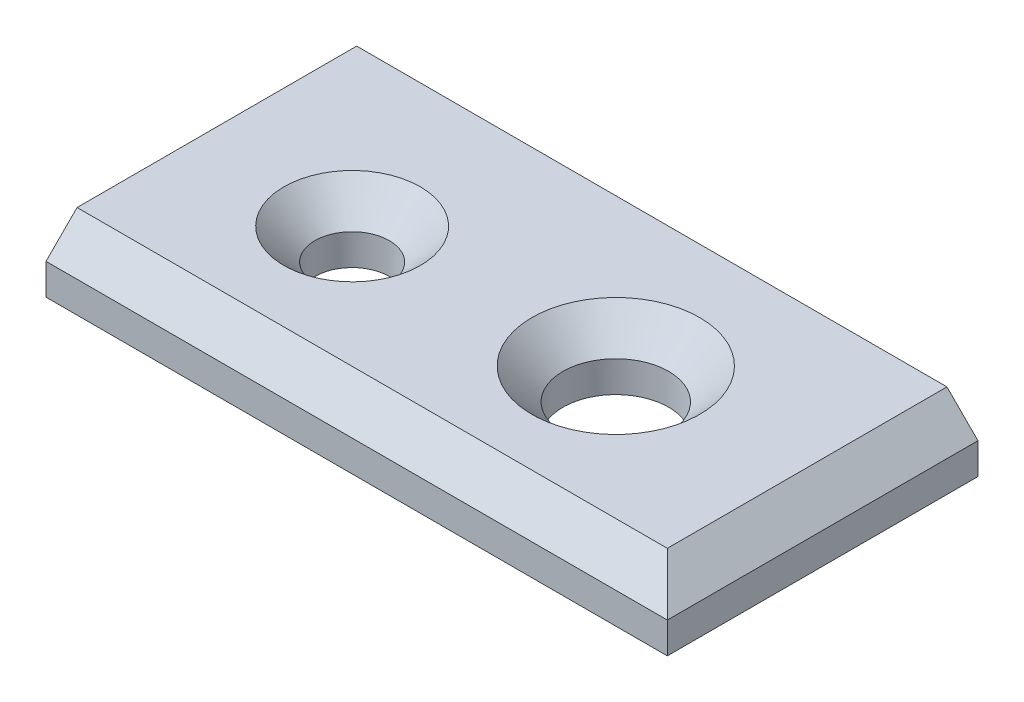
ISO-10303-21;
HEADER;
FILE_DESCRIPTION(('STEP AP214'),'2;1');
FILE_NAME('part.step','',(''),(''),'','','');
FILE_SCHEMA(('AUTOMOTIVE_DESIGN { 1 0 10303 214 1 1 1 1 }'));
ENDSEC;
DATA;
#1=APPLICATION_CONTEXT('core data for automotive mechanical design processes');
#2=APPLICATION_PROTOCOL_DEFINITION('international standard','automotive_design',2000,#1);
#3=PRODUCT_CONTEXT('',#1,'mechanical');
#4=PRODUCT('Part','Part','',(#3));
#5=PRODUCT_RELATED_PRODUCT_CATEGORY('part','',(#4));
#6=PRODUCT_DEFINITION_FORMATION('','',#4);
#7=PRODUCT_DEFINITION_CONTEXT('part definition',#1,'design');
#8=PRODUCT_DEFINITION('design','',#6,#7);
#9=PRODUCT_DEFINITION_SHAPE('','',#8);
#10=(LENGTH_UNIT() NAMED_UNIT(*) SI_UNIT(.MILLI.,.METRE.));
#11=(NAMED_UNIT(*) PLANE_ANGLE_UNIT() SI_UNIT($,.RADIAN.));
#12=(NAMED_UNIT(*) SI_UNIT($,.STERADIAN.) SOLID_ANGLE_UNIT());
#13=UNCERTAINTY_MEASURE_WITH_UNIT(LENGTH_MEASURE(1.E-05),#10,'distance_accuracy_value','');
#14=(GEOMETRIC_REPRESENTATION_CONTEXT(3) GLOBAL_UNCERTAINTY_ASSIGNED_CONTEXT((#13)) GLOBAL_UNIT_ASSIGNED_CONTEXT((#10,
#11,#12)) REPRESENTATION_CONTEXT('',''));
#15=CARTESIAN_POINT('',(0.,0.,0.));
#16=DIRECTION('',(0.,0.,1.));
#17=DIRECTION('',(1.,0.,0.));
#18=AXIS2_PLACEMENT_3D('',#15,#16,#17);
#19=CARTESIAN_POINT('',(0.,10.,0.));
#20=DIRECTION('',(1.,0.,0.));
#21=DIRECTION('',(0.,0.,-1.));
#22=AXIS2_PLACEMENT_3D('',#19,#20,#21);
#23=PLANE('',#22);
#24=DIRECTION('',(0.,-1.,0.));
#25=VECTOR('',#24,1.);
#26=CARTESIAN_POINT('',(0.,10.,0.));
#27=LINE('',#26,#25);
#28=CARTESIAN_POINT('',(0.,5.,0.));
#29=VERTEX_POINT('',#28);
#30=CARTESIAN_POINT('',(0.,0.,0.));
#31=VERTEX_POINT('',#30);
#32=EDGE_CURVE('E158',#29,#31,#27,.T.);
#33=ORIENTED_EDGE('',*,*,#32,.F.);
#34=DIRECTION('',(0.,-0.707106781186549,0.707106781186547));
#35=VECTOR('',#34,1.);
#36=CARTESIAN_POINT('',(0.,10.,-4.99999999999999));
#37=LINE('',#36,#35);
#38=CARTESIAN_POINT('',(0.,10.,-4.99999999999999));
#39=VERTEX_POINT('',#38);
#40=EDGE_CURVE('E132',#29,#39,#37,.F.);
#41=ORIENTED_EDGE('',*,*,#40,.T.);
#42=DIRECTION('',(0.,0.,1.));
#43=VECTOR('',#42,1.);
#44=CARTESIAN_POINT('',(0.,10.,0.));
#45=LINE('',#44,#43);
#46=CARTESIAN_POINT('',(0.,10.,-50.));
#47=VERTEX_POINT('',#46);
#48=EDGE_CURVE('E113',#47,#39,#45,.T.);
#49=ORIENTED_EDGE('',*,*,#48,.F.);
#50=DIRECTION('',(0.,-1.,0.));
#51=VECTOR('',#50,1.);
#52=CARTESIAN_POINT('',(0.,10.,-50.));
#53=LINE('',#52,#51);
#54=CARTESIAN_POINT('',(0.,0.,-50.));
#55=VERTEX_POINT('',#54);
#56=EDGE_CURVE('E119',#47,#55,#53,.T.);
#57=ORIENTED_EDGE('',*,*,#56,.T.);
#58=DIRECTION('',(0.,0.,1.));
#59=VECTOR('',#58,1.);
#60=CARTESIAN_POINT('',(0.,0.,0.));
#61=LINE('',#60,#59);
#62=EDGE_CURVE('E143',#55,#31,#61,.T.);
#63=ORIENTED_EDGE('',*,*,#62,.T.);
#64=EDGE_LOOP('',(#33,#41,#49,#57,#63));
#65=FACE_BOUND('',#64,.T.);
#66=ADVANCED_FACE('F41',(#65),#23,.F.);
#67=CARTESIAN_POINT('',(0.,10.,0.));
#68=DIRECTION('',(0.,0.,-1.));
#69=DIRECTION('',(-1.,0.,0.));
#70=AXIS2_PLACEMENT_3D('',#67,#68,#69);
#71=PLANE('',#70);
#72=DIRECTION('',(0.,-1.,0.));
#73=VECTOR('',#72,1.);
#74=CARTESIAN_POINT('',(100.,10.,0.));
#75=LINE('',#74,#73);
#76=CARTESIAN_POINT('',(100.,5.,0.));
#77=VERTEX_POINT('',#76);
#78=CARTESIAN_POINT('',(100.,0.,0.));
#79=VERTEX_POINT('',#78);
#80=EDGE_CURVE('E155',#77,#79,#75,.T.);
#81=ORIENTED_EDGE('',*,*,#80,.F.);
#82=DIRECTION('',(-1.,0.,0.));
#83=VECTOR('',#82,1.);
#84=CARTESIAN_POINT('',(0.,5.,0.));
#85=LINE('',#84,#83);
#86=EDGE_CURVE('E61',#77,#29,#85,.T.);
#87=ORIENTED_EDGE('',*,*,#86,.T.);
#88=ORIENTED_EDGE('',*,*,#32,.T.);
#89=DIRECTION('',(1.,0.,0.));
#90=VECTOR('',#89,1.);
#91=CARTESIAN_POINT('',(0.,0.,0.));
#92=LINE('',#91,#90);
#93=EDGE_CURVE('E146',#31,#79,#92,.T.);
#94=ORIENTED_EDGE('',*,*,#93,.T.);
#95=EDGE_LOOP('',(#81,#87,#88,#94));
#96=FACE_BOUND('',#95,.T.);
#97=ADVANCED_FACE('F204',(#96),#71,.F.);
#98=CARTESIAN_POINT('',(100.,10.,0.));
#99=DIRECTION('',(-1.,0.,0.));
#100=DIRECTION('',(0.,0.,1.));
#101=AXIS2_PLACEMENT_3D('',#98,#99,#100);
#102=PLANE('',#101);
#103=DIRECTION('',(0.,-1.,0.));
#104=VECTOR('',#103,1.);
#105=CARTESIAN_POINT('',(100.,10.,-50.));
#106=LINE('',#105,#104);
#107=CARTESIAN_POINT('',(100.,5.,-50.));
#108=VERTEX_POINT('',#107);
#109=CARTESIAN_POINT('',(100.,0.,-50.));
#110=VERTEX_POINT('',#109);
#111=EDGE_CURVE('E129',#108,#110,#106,.T.);
#112=ORIENTED_EDGE('',*,*,#111,.F.);
#113=DIRECTION('',(0.,0.,1.));
#114=VECTOR('',#113,1.);
#115=CARTESIAN_POINT('',(100.,5.,0.));
#116=LINE('',#115,#114);
#117=EDGE_CURVE('E71',#108,#77,#116,.T.);
#118=ORIENTED_EDGE('',*,*,#117,.T.);
#119=ORIENTED_EDGE('',*,*,#80,.T.);
#120=DIRECTION('',(0.,0.,-1.));
#121=VECTOR('',#120,1.);
#122=CARTESIAN_POINT('',(100.,0.,0.));
#123=LINE('',#122,#121);
#124=EDGE_CURVE('E137',#79,#110,#123,.T.);
#125=ORIENTED_EDGE('',*,*,#124,.T.);
#126=EDGE_LOOP('',(#112,#118,#119,#125));
#127=FACE_BOUND('',#126,.T.);
#128=ADVANCED_FACE('F209',(#127),#102,.F.);
#129=CARTESIAN_POINT('',(0.,10.,-50.));
#130=DIRECTION('',(0.,0.,1.));
#131=DIRECTION('',(1.,0.,0.));
#132=AXIS2_PLACEMENT_3D('',#129,#130,#131);
#133=PLANE('',#132);
#134=DIRECTION('',(-1.,0.,0.));
#135=VECTOR('',#134,1.);
#136=CARTESIAN_POINT('',(0.,10.,-50.));
#137=LINE('',#136,#135);
#138=CARTESIAN_POINT('',(95.,10.,-50.));
#139=VERTEX_POINT('',#138);
#140=EDGE_CURVE('E109',#139,#47,#137,.T.);
#141=ORIENTED_EDGE('',*,*,#140,.F.);
#142=DIRECTION('',(-0.707106781186547,0.707106781186549,0.));
#143=VECTOR('',#142,1.);
#144=CARTESIAN_POINT('',(95.,10.,-50.));
#145=LINE('',#144,#143);
#146=EDGE_CURVE('E174',#139,#108,#145,.F.);
#147=ORIENTED_EDGE('',*,*,#146,.T.);
#148=ORIENTED_EDGE('',*,*,#111,.T.);
#149=DIRECTION('',(-1.,0.,0.));
#150=VECTOR('',#149,1.);
#151=CARTESIAN_POINT('',(0.,0.,-50.));
#152=LINE('',#151,#150);
#153=EDGE_CURVE('E124',#110,#55,#152,.T.);
#154=ORIENTED_EDGE('',*,*,#153,.T.);
#155=ORIENTED_EDGE('',*,*,#56,.F.);
#156=EDGE_LOOP('',(#141,#147,#148,#154,#155));
#157=FACE_BOUND('',#156,.T.);
#158=ADVANCED_FACE('F122',(#157),#133,.F.);
#159=CARTESIAN_POINT('',(0.,10.,0.));
#160=DIRECTION('',(0.,-1.,0.));
#161=DIRECTION('',(0.,0.,-1.));
#162=AXIS2_PLACEMENT_3D('',#159,#160,#161);
#163=PLANE('',#162);
#164=CARTESIAN_POINT('',(65.4402174989173,10.,-26.2667727531607));
#165=DIRECTION('',(0.,-1.,0.));
#166=DIRECTION('',(0.,0.,-1.));
#167=AXIS2_PLACEMENT_3D('',#164,#165,#166);
#168=CIRCLE('',#167,13.5047904125237);
#169=CARTESIAN_POINT('',(65.4402174989173,10.,-39.7715631656844));
#170=VERTEX_POINT('',#169);
#171=EDGE_CURVE('E11',#170,#170,#168,.T.);
#172=ORIENTED_EDGE('',*,*,#171,.T.);
#173=EDGE_LOOP('',(#172));
#174=FACE_BOUND('',#173,.T.);
#175=CARTESIAN_POINT('',(24.734846155809,10.,-24.5365151521924));
#176=DIRECTION('',(0.,-1.,0.));
#177=DIRECTION('',(0.,0.,-1.));
#178=AXIS2_PLACEMENT_3D('',#175,#176,#177);
#179=CIRCLE('',#178,10.9790058142528);
#180=CARTESIAN_POINT('',(24.734846155809,10.,-35.5155209664452));
#181=VERTEX_POINT('',#180);
#182=EDGE_CURVE('E170',#181,#181,#179,.T.);
#183=ORIENTED_EDGE('',*,*,#182,.T.);
#184=EDGE_LOOP('',(#183));
#185=FACE_BOUND('',#184,.T.);
#186=DIRECTION('',(1.,0.,0.));
#187=VECTOR('',#186,1.);
#188=CARTESIAN_POINT('',(0.,10.,-4.99999999999999));
#189=LINE('',#188,#187);
#190=CARTESIAN_POINT('',(95.,10.,-4.99999999999999));
#191=VERTEX_POINT('',#190);
#192=EDGE_CURVE('E165',#39,#191,#189,.T.);
#193=ORIENTED_EDGE('',*,*,#192,.T.);
#194=DIRECTION('',(0.,0.,-1.));
#195=VECTOR('',#194,1.);
#196=CARTESIAN_POINT('',(95.,10.,0.));
#197=LINE('',#196,#195);
#198=EDGE_CURVE('E116',#191,#139,#197,.T.);
#199=ORIENTED_EDGE('',*,*,#198,.T.);
#200=ORIENTED_EDGE('',*,*,#140,.T.);
#201=ORIENTED_EDGE('',*,*,#48,.T.);
#202=EDGE_LOOP('',(#193,#199,#200,#201));
#203=FACE_BOUND('',#202,.T.);
#204=ADVANCED_FACE('F111',(#174,#185,#203),#163,.F.);
#205=CARTESIAN_POINT('',(0.,0.,0.));
#206=DIRECTION('',(0.,-1.,0.));
#207=DIRECTION('',(0.,0.,-1.));
#208=AXIS2_PLACEMENT_3D('',#205,#206,#207);
#209=PLANE('',#208);
#210=CARTESIAN_POINT('',(65.4402174989173,0.,-26.2667727531607));
#211=DIRECTION('',(0.,1.,0.));
#212=DIRECTION('',(0.,0.,1.));
#213=AXIS2_PLACEMENT_3D('',#210,#211,#212);
#214=CIRCLE('',#213,8.50479041252366);
#215=CARTESIAN_POINT('',(65.4402174989173,0.,-17.761982340637));
#216=VERTEX_POINT('',#215);
#217=EDGE_CURVE('E186',#216,#216,#214,.T.);
#218=ORIENTED_EDGE('',*,*,#217,.T.);
#219=EDGE_LOOP('',(#218));
#220=FACE_BOUND('',#219,.T.);
#221=CARTESIAN_POINT('',(24.734846155809,0.,-24.5365151521924));
#222=DIRECTION('',(0.,1.,0.));
#223=DIRECTION('',(0.,0.,1.));
#224=AXIS2_PLACEMENT_3D('',#221,#222,#223);
#225=CIRCLE('',#224,5.97900581425279);
#226=CARTESIAN_POINT('',(24.734846155809,0.,-18.5575093379396));
#227=VERTEX_POINT('',#226);
#228=EDGE_CURVE('E140',#227,#227,#225,.T.);
#229=ORIENTED_EDGE('',*,*,#228,.T.);
#230=EDGE_LOOP('',(#229));
#231=FACE_BOUND('',#230,.T.);
#232=ORIENTED_EDGE('',*,*,#62,.F.);
#233=ORIENTED_EDGE('',*,*,#153,.F.);
#234=ORIENTED_EDGE('',*,*,#124,.F.);
#235=ORIENTED_EDGE('',*,*,#93,.F.);
#236=EDGE_LOOP('',(#232,#233,#234,#235));
#237=FACE_BOUND('',#236,.T.);
#238=ADVANCED_FACE('F229',(#220,#231,#237),#209,.T.);
#239=CARTESIAN_POINT('',(24.734846155809,0.,-24.5365151521924));
#240=DIRECTION('',(0.,1.,0.));
#241=DIRECTION('',(0.,0.,1.));
#242=AXIS2_PLACEMENT_3D('',#239,#240,#241);
#243=CYLINDRICAL_SURFACE('',#242,5.97900581425279);
#244=CARTESIAN_POINT('',(24.734846155809,4.99999999999999,-24.5365151521924));
#245=DIRECTION('',(0.,-1.,0.));
#246=DIRECTION('',(0.,0.,-1.));
#247=AXIS2_PLACEMENT_3D('',#244,#245,#246);
#248=CIRCLE('',#247,5.97900581425279);
#249=CARTESIAN_POINT('',(24.734846155809,4.99999999999999,-30.5155209664451));
#250=VERTEX_POINT('',#249);
#251=EDGE_CURVE('E161',#250,#250,#248,.F.);
#252=ORIENTED_EDGE('',*,*,#251,.T.);
#253=EDGE_LOOP('',(#252));
#254=FACE_BOUND('',#253,.T.);
#255=ORIENTED_EDGE('',*,*,#228,.F.);
#256=EDGE_LOOP('',(#255));
#257=FACE_BOUND('',#256,.T.);
#258=ADVANCED_FACE('F217',(#254,#257),#243,.F.);
#259=CARTESIAN_POINT('',(24.734846155809,4.99999999999999,-24.5365151521924));
#260=DIRECTION('',(0.,1.,0.));
#261=DIRECTION('',(0.,0.,1.));
#262=AXIS2_PLACEMENT_3D('',#259,#260,#261);
#263=CONICAL_SURFACE('',#262,5.97900581425279,0.78539816339745);
#264=ORIENTED_EDGE('',*,*,#182,.F.);
#265=EDGE_LOOP('',(#264));
#266=FACE_BOUND('',#265,.T.);
#267=ORIENTED_EDGE('',*,*,#251,.F.);
#268=EDGE_LOOP('',(#267));
#269=FACE_BOUND('',#268,.T.);
#270=ADVANCED_FACE('F213',(#266,#269),#263,.F.);
#271=CARTESIAN_POINT('',(0.,10.,-4.99999999999999));
#272=DIRECTION('',(0.,-0.707106781186546,-0.707106781186548));
#273=DIRECTION('',(1.,0.,0.));
#274=AXIS2_PLACEMENT_3D('',#271,#272,#273);
#275=PLANE('',#274);
#276=ORIENTED_EDGE('',*,*,#40,.F.);
#277=ORIENTED_EDGE('',*,*,#86,.F.);
#278=DIRECTION('',(-0.577350269189625,0.577350269189627,-0.577350269189625));
#279=VECTOR('',#278,1.);
#280=CARTESIAN_POINT('',(63.3333333333334,41.6666666666667,-36.6666666666666));
#281=LINE('',#280,#279);
#282=EDGE_CURVE('E183',#191,#77,#281,.F.);
#283=ORIENTED_EDGE('',*,*,#282,.F.);
#284=ORIENTED_EDGE('',*,*,#192,.F.);
#285=EDGE_LOOP('',(#276,#277,#283,#284));
#286=FACE_BOUND('',#285,.T.);
#287=ADVANCED_FACE('F216',(#286),#275,.F.);
#288=CARTESIAN_POINT('',(95.,10.,0.));
#289=DIRECTION('',(-0.707106781186548,-0.707106781186546,0.));
#290=DIRECTION('',(0.,0.,-1.));
#291=AXIS2_PLACEMENT_3D('',#288,#289,#290);
#292=PLANE('',#291);
#293=ORIENTED_EDGE('',*,*,#282,.T.);
#294=ORIENTED_EDGE('',*,*,#117,.F.);
#295=ORIENTED_EDGE('',*,*,#146,.F.);
#296=ORIENTED_EDGE('',*,*,#198,.F.);
#297=EDGE_LOOP('',(#293,#294,#295,#296));
#298=FACE_BOUND('',#297,.T.);
#299=ADVANCED_FACE('F200',(#298),#292,.F.);
#300=CARTESIAN_POINT('',(65.4402174989173,0.,-26.2667727531607));
#301=DIRECTION('',(0.,1.,0.));
#302=DIRECTION('',(0.,0.,1.));
#303=AXIS2_PLACEMENT_3D('',#300,#301,#302);
#304=CYLINDRICAL_SURFACE('',#303,8.50479041252366);
#305=CARTESIAN_POINT('',(65.4402174989173,5.,-26.2667727531607));
#306=DIRECTION('',(0.,-1.,0.));
#307=DIRECTION('',(0.,0.,-1.));
#308=AXIS2_PLACEMENT_3D('',#305,#306,#307);
#309=CIRCLE('',#308,8.50479041252366);
#310=CARTESIAN_POINT('',(65.4402174989173,5.,-34.7715631656844));
#311=VERTEX_POINT('',#310);
#312=EDGE_CURVE('E50',#311,#311,#309,.F.);
#313=ORIENTED_EDGE('',*,*,#312,.T.);
#314=EDGE_LOOP('',(#313));
#315=FACE_BOUND('',#314,.T.);
#316=ORIENTED_EDGE('',*,*,#217,.F.);
#317=EDGE_LOOP('',(#316));
#318=FACE_BOUND('',#317,.T.);
#319=ADVANCED_FACE('F192',(#315,#318),#304,.F.);
#320=CARTESIAN_POINT('',(65.4402174989173,5.,-26.2667727531607));
#321=DIRECTION('',(0.,1.,0.));
#322=DIRECTION('',(0.,0.,1.));
#323=AXIS2_PLACEMENT_3D('',#320,#321,#322);
#324=CONICAL_SURFACE('',#323,8.50479041252366,0.785398163397451);
#325=ORIENTED_EDGE('',*,*,#171,.F.);
#326=EDGE_LOOP('',(#325));
#327=FACE_BOUND('',#326,.T.);
#328=ORIENTED_EDGE('',*,*,#312,.F.);
#329=EDGE_LOOP('',(#328));
#330=FACE_BOUND('',#329,.T.);
#331=ADVANCED_FACE('F43',(#327,#330),#324,.F.);
#332=CLOSED_SHELL('',(#66,#97,#128,#158,#204,#238,#258,#270,#287,#299,#319,#331));
#333=MANIFOLD_SOLID_BREP('B2',#332);
#334=ADVANCED_BREP_SHAPE_REPRESENTATION('',(#18,#333),#14);
#335=SHAPE_DEFINITION_REPRESENTATION(#9,#334);
ENDSEC;
END-ISO-10303-21;
